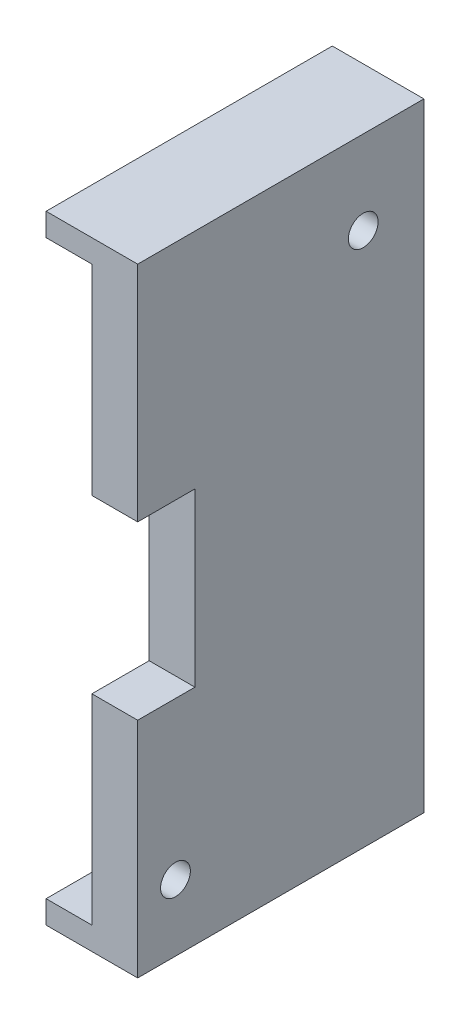
ISO-10303-21;
HEADER;
FILE_DESCRIPTION(('STEP AP214'),'2;1');
FILE_NAME('part.step','',(''),(''),'','','');
FILE_SCHEMA(('AUTOMOTIVE_DESIGN { 1 0 10303 214 1 1 1 1 }'));
ENDSEC;
DATA;
#1=APPLICATION_CONTEXT('core data for automotive mechanical design processes');
#2=APPLICATION_PROTOCOL_DEFINITION('international standard','automotive_design',2000,#1);
#3=PRODUCT_CONTEXT('',#1,'mechanical');
#4=PRODUCT('Part','Part','',(#3));
#5=PRODUCT_RELATED_PRODUCT_CATEGORY('part','',(#4));
#6=PRODUCT_DEFINITION_FORMATION('','',#4);
#7=PRODUCT_DEFINITION_CONTEXT('part definition',#1,'design');
#8=PRODUCT_DEFINITION('design','',#6,#7);
#9=PRODUCT_DEFINITION_SHAPE('','',#8);
#10=(LENGTH_UNIT() NAMED_UNIT(*) SI_UNIT(.MILLI.,.METRE.));
#11=(NAMED_UNIT(*) PLANE_ANGLE_UNIT() SI_UNIT($,.RADIAN.));
#12=(NAMED_UNIT(*) SI_UNIT($,.STERADIAN.) SOLID_ANGLE_UNIT());
#13=UNCERTAINTY_MEASURE_WITH_UNIT(LENGTH_MEASURE(1.E-05),#10,'distance_accuracy_value','');
#14=(GEOMETRIC_REPRESENTATION_CONTEXT(3) GLOBAL_UNCERTAINTY_ASSIGNED_CONTEXT((#13)) GLOBAL_UNIT_ASSIGNED_CONTEXT((#10,
#11,#12)) REPRESENTATION_CONTEXT('',''));
#15=CARTESIAN_POINT('',(0.,0.,0.));
#16=DIRECTION('',(0.,0.,1.));
#17=DIRECTION('',(1.,0.,0.));
#18=AXIS2_PLACEMENT_3D('',#15,#16,#17);
#19=CARTESIAN_POINT('',(90.,24.,-100.));
#20=DIRECTION('',(0.,0.,1.));
#21=DIRECTION('',(1.,0.,0.));
#22=AXIS2_PLACEMENT_3D('',#19,#20,#21);
#23=PLANE('',#22);
#24=DIRECTION('',(0.,-1.,0.));
#25=VECTOR('',#24,1.);
#26=CARTESIAN_POINT('',(94.,22.,-100.));
#27=LINE('',#26,#25);
#28=CARTESIAN_POINT('',(94.,22.,-100.));
#29=VERTEX_POINT('',#28);
#30=CARTESIAN_POINT('',(94.,4.5,-100.));
#31=VERTEX_POINT('',#30);
#32=EDGE_CURVE('E177',#29,#31,#27,.T.);
#33=ORIENTED_EDGE('',*,*,#32,.T.);
#34=DIRECTION('',(-1.,0.,0.));
#35=VECTOR('',#34,1.);
#36=CARTESIAN_POINT('',(98.,4.5,-100.));
#37=LINE('',#36,#35);
#38=CARTESIAN_POINT('',(98.,4.5,-100.));
#39=VERTEX_POINT('',#38);
#40=EDGE_CURVE('E151',#39,#31,#37,.T.);
#41=ORIENTED_EDGE('',*,*,#40,.F.);
#42=DIRECTION('',(0.,-1.,0.));
#43=VECTOR('',#42,1.);
#44=CARTESIAN_POINT('',(98.,24.,-100.));
#45=LINE('',#44,#43);
#46=CARTESIAN_POINT('',(98.,24.,-100.));
#47=VERTEX_POINT('',#46);
#48=EDGE_CURVE('E157',#47,#39,#45,.T.);
#49=ORIENTED_EDGE('',*,*,#48,.F.);
#50=DIRECTION('',(1.,0.,0.));
#51=VECTOR('',#50,1.);
#52=CARTESIAN_POINT('',(90.,24.,-100.));
#53=LINE('',#52,#51);
#54=CARTESIAN_POINT('',(90.,24.,-100.));
#55=VERTEX_POINT('',#54);
#56=EDGE_CURVE('E232',#55,#47,#53,.T.);
#57=ORIENTED_EDGE('',*,*,#56,.F.);
#58=DIRECTION('',(0.,-1.,0.));
#59=VECTOR('',#58,1.);
#60=CARTESIAN_POINT('',(90.,24.,-100.));
#61=LINE('',#60,#59);
#62=CARTESIAN_POINT('',(90.,22.,-100.));
#63=VERTEX_POINT('',#62);
#64=EDGE_CURVE('E221',#55,#63,#61,.T.);
#65=ORIENTED_EDGE('',*,*,#64,.T.);
#66=DIRECTION('',(-1.,0.,0.));
#67=VECTOR('',#66,1.);
#68=CARTESIAN_POINT('',(94.,22.,-100.));
#69=LINE('',#68,#67);
#70=EDGE_CURVE('E199',#29,#63,#69,.T.);
#71=ORIENTED_EDGE('',*,*,#70,.F.);
#72=EDGE_LOOP('',(#33,#41,#49,#57,#65,#71));
#73=FACE_BOUND('',#72,.T.);
#74=ADVANCED_FACE('F43',(#73),#23,.T.);
#75=CARTESIAN_POINT('',(98.,-10.5,-100.));
#76=VERTEX_POINT('',#75);
#77=CARTESIAN_POINT('',(98.,-30.,-100.));
#78=VERTEX_POINT('',#77);
#79=EDGE_CURVE('E205',#76,#78,#45,.T.);
#80=ORIENTED_EDGE('',*,*,#79,.F.);
#81=DIRECTION('',(-1.,0.,0.));
#82=VECTOR('',#81,1.);
#83=CARTESIAN_POINT('',(98.,-10.5,-100.));
#84=LINE('',#83,#82);
#85=CARTESIAN_POINT('',(94.,-10.5,-100.));
#86=VERTEX_POINT('',#85);
#87=EDGE_CURVE('E167',#76,#86,#84,.T.);
#88=ORIENTED_EDGE('',*,*,#87,.T.);
#89=CARTESIAN_POINT('',(94.,-28.,-100.));
#90=VERTEX_POINT('',#89);
#91=EDGE_CURVE('E176',#86,#90,#27,.T.);
#92=ORIENTED_EDGE('',*,*,#91,.T.);
#93=DIRECTION('',(-1.,0.,0.));
#94=VECTOR('',#93,1.);
#95=CARTESIAN_POINT('',(94.,-28.,-100.));
#96=LINE('',#95,#94);
#97=CARTESIAN_POINT('',(90.,-28.,-100.));
#98=VERTEX_POINT('',#97);
#99=EDGE_CURVE('E195',#90,#98,#96,.T.);
#100=ORIENTED_EDGE('',*,*,#99,.T.);
#101=CARTESIAN_POINT('',(90.,-30.,-100.));
#102=VERTEX_POINT('',#101);
#103=EDGE_CURVE('E220',#98,#102,#61,.T.);
#104=ORIENTED_EDGE('',*,*,#103,.T.);
#105=DIRECTION('',(1.,0.,0.));
#106=VECTOR('',#105,1.);
#107=CARTESIAN_POINT('',(90.,-30.,-100.));
#108=LINE('',#107,#106);
#109=EDGE_CURVE('E240',#102,#78,#108,.T.);
#110=ORIENTED_EDGE('',*,*,#109,.T.);
#111=EDGE_LOOP('',(#80,#88,#92,#100,#104,#110));
#112=FACE_BOUND('',#111,.T.);
#113=ADVANCED_FACE('F282',(#112),#23,.T.);
#114=CARTESIAN_POINT('',(98.,0.,0.));
#115=DIRECTION('',(1.,0.,0.));
#116=DIRECTION('',(0.,0.,-1.));
#117=AXIS2_PLACEMENT_3D('',#114,#115,#116);
#118=PLANE('',#117);
#119=CARTESIAN_POINT('',(98.,16.7,-119.7));
#120=DIRECTION('',(1.,0.,0.));
#121=DIRECTION('',(0.,0.,-1.));
#122=AXIS2_PLACEMENT_3D('',#119,#120,#121);
#123=CIRCLE('',#122,1.29999999999999);
#124=CARTESIAN_POINT('',(98.,16.7,-121.));
#125=VERTEX_POINT('',#124);
#126=EDGE_CURVE('E263',#125,#125,#123,.T.);
#127=ORIENTED_EDGE('',*,*,#126,.F.);
#128=EDGE_LOOP('',(#127));
#129=FACE_BOUND('',#128,.T.);
#130=CARTESIAN_POINT('',(98.,-24.2,-103.3));
#131=DIRECTION('',(1.,0.,0.));
#132=DIRECTION('',(0.,0.,-1.));
#133=AXIS2_PLACEMENT_3D('',#130,#131,#132);
#134=CIRCLE('',#133,1.29999999999999);
#135=CARTESIAN_POINT('',(98.,-24.2,-104.6));
#136=VERTEX_POINT('',#135);
#137=EDGE_CURVE('E270',#136,#136,#134,.T.);
#138=ORIENTED_EDGE('',*,*,#137,.F.);
#139=EDGE_LOOP('',(#138));
#140=FACE_BOUND('',#139,.T.);
#141=ORIENTED_EDGE('',*,*,#48,.T.);
#142=DIRECTION('',(0.,0.,1.));
#143=VECTOR('',#142,1.);
#144=CARTESIAN_POINT('',(98.,4.5,-105.));
#145=LINE('',#144,#143);
#146=CARTESIAN_POINT('',(98.,4.5,-105.));
#147=VERTEX_POINT('',#146);
#148=EDGE_CURVE('E143',#147,#39,#145,.T.);
#149=ORIENTED_EDGE('',*,*,#148,.F.);
#150=DIRECTION('',(0.,1.,0.));
#151=VECTOR('',#150,1.);
#152=CARTESIAN_POINT('',(98.,4.5,-105.));
#153=LINE('',#152,#151);
#154=CARTESIAN_POINT('',(98.,-10.5,-105.));
#155=VERTEX_POINT('',#154);
#156=EDGE_CURVE('E134',#155,#147,#153,.T.);
#157=ORIENTED_EDGE('',*,*,#156,.F.);
#158=DIRECTION('',(0.,0.,-1.));
#159=VECTOR('',#158,1.);
#160=CARTESIAN_POINT('',(98.,-10.5,-105.));
#161=LINE('',#160,#159);
#162=EDGE_CURVE('E159',#76,#155,#161,.T.);
#163=ORIENTED_EDGE('',*,*,#162,.F.);
#164=ORIENTED_EDGE('',*,*,#79,.T.);
#165=DIRECTION('',(0.,0.,1.));
#166=VECTOR('',#165,1.);
#167=CARTESIAN_POINT('',(98.,-30.,-125.));
#168=LINE('',#167,#166);
#169=CARTESIAN_POINT('',(98.,-30.,-125.));
#170=VERTEX_POINT('',#169);
#171=EDGE_CURVE('E208',#170,#78,#168,.T.);
#172=ORIENTED_EDGE('',*,*,#171,.F.);
#173=DIRECTION('',(0.,-1.,0.));
#174=VECTOR('',#173,1.);
#175=CARTESIAN_POINT('',(98.,24.,-125.));
#176=LINE('',#175,#174);
#177=CARTESIAN_POINT('',(98.,24.,-125.));
#178=VERTEX_POINT('',#177);
#179=EDGE_CURVE('E212',#178,#170,#176,.T.);
#180=ORIENTED_EDGE('',*,*,#179,.F.);
#181=DIRECTION('',(0.,0.,1.));
#182=VECTOR('',#181,1.);
#183=CARTESIAN_POINT('',(98.,24.,-125.));
#184=LINE('',#183,#182);
#185=EDGE_CURVE('E202',#178,#47,#184,.T.);
#186=ORIENTED_EDGE('',*,*,#185,.T.);
#187=EDGE_LOOP('',(#141,#149,#157,#163,#164,#172,#180,#186));
#188=FACE_BOUND('',#187,.T.);
#189=ADVANCED_FACE('F154',(#129,#140,#188),#118,.T.);
#190=CARTESIAN_POINT('',(94.,0.,0.));
#191=DIRECTION('',(1.,0.,0.));
#192=DIRECTION('',(0.,0.,-1.));
#193=AXIS2_PLACEMENT_3D('',#190,#191,#192);
#194=PLANE('',#193);
#195=CARTESIAN_POINT('',(94.,16.7,-119.7));
#196=DIRECTION('',(1.,0.,0.));
#197=DIRECTION('',(0.,0.,-1.));
#198=AXIS2_PLACEMENT_3D('',#195,#196,#197);
#199=CIRCLE('',#198,1.29999999999999);
#200=CARTESIAN_POINT('',(94.,16.7,-121.));
#201=VERTEX_POINT('',#200);
#202=EDGE_CURVE('E47',#201,#201,#199,.F.);
#203=ORIENTED_EDGE('',*,*,#202,.F.);
#204=EDGE_LOOP('',(#203));
#205=FACE_BOUND('',#204,.T.);
#206=CARTESIAN_POINT('',(94.,-24.2,-103.3));
#207=DIRECTION('',(1.,0.,0.));
#208=DIRECTION('',(0.,0.,-1.));
#209=AXIS2_PLACEMENT_3D('',#206,#207,#208);
#210=CIRCLE('',#209,1.29999999999999);
#211=CARTESIAN_POINT('',(94.,-24.2,-104.6));
#212=VERTEX_POINT('',#211);
#213=EDGE_CURVE('E260',#212,#212,#210,.F.);
#214=ORIENTED_EDGE('',*,*,#213,.F.);
#215=EDGE_LOOP('',(#214));
#216=FACE_BOUND('',#215,.T.);
#217=DIRECTION('',(0.,0.,-1.));
#218=VECTOR('',#217,1.);
#219=CARTESIAN_POINT('',(94.,4.50000000000001,0.));
#220=LINE('',#219,#218);
#221=CARTESIAN_POINT('',(94.,4.5,-105.));
#222=VERTEX_POINT('',#221);
#223=EDGE_CURVE('E11',#31,#222,#220,.T.);
#224=ORIENTED_EDGE('',*,*,#223,.F.);
#225=ORIENTED_EDGE('',*,*,#32,.F.);
#226=DIRECTION('',(0.,0.,1.));
#227=VECTOR('',#226,1.);
#228=CARTESIAN_POINT('',(94.,22.,-122.));
#229=LINE('',#228,#227);
#230=CARTESIAN_POINT('',(94.,22.,-122.));
#231=VERTEX_POINT('',#230);
#232=EDGE_CURVE('E150',#231,#29,#229,.T.);
#233=ORIENTED_EDGE('',*,*,#232,.F.);
#234=DIRECTION('',(0.,-1.,0.));
#235=VECTOR('',#234,1.);
#236=CARTESIAN_POINT('',(94.,22.,-122.));
#237=LINE('',#236,#235);
#238=CARTESIAN_POINT('',(94.,-28.,-122.));
#239=VERTEX_POINT('',#238);
#240=EDGE_CURVE('E185',#231,#239,#237,.T.);
#241=ORIENTED_EDGE('',*,*,#240,.T.);
#242=DIRECTION('',(0.,0.,1.));
#243=VECTOR('',#242,1.);
#244=CARTESIAN_POINT('',(94.,-28.,-122.));
#245=LINE('',#244,#243);
#246=EDGE_CURVE('E181',#239,#90,#245,.T.);
#247=ORIENTED_EDGE('',*,*,#246,.T.);
#248=ORIENTED_EDGE('',*,*,#91,.F.);
#249=DIRECTION('',(0.,0.,1.));
#250=VECTOR('',#249,1.);
#251=CARTESIAN_POINT('',(94.,-10.5,0.));
#252=LINE('',#251,#250);
#253=CARTESIAN_POINT('',(94.,-10.5,-105.));
#254=VERTEX_POINT('',#253);
#255=EDGE_CURVE('E256',#254,#86,#252,.T.);
#256=ORIENTED_EDGE('',*,*,#255,.F.);
#257=DIRECTION('',(0.,-1.,0.));
#258=VECTOR('',#257,1.);
#259=CARTESIAN_POINT('',(94.,0.,-105.));
#260=LINE('',#259,#258);
#261=EDGE_CURVE('E53',#222,#254,#260,.T.);
#262=ORIENTED_EDGE('',*,*,#261,.F.);
#263=EDGE_LOOP('',(#224,#225,#233,#241,#247,#248,#256,#262));
#264=FACE_BOUND('',#263,.T.);
#265=ADVANCED_FACE('F281',(#205,#216,#264),#194,.F.);
#266=CARTESIAN_POINT('',(90.,0.,0.));
#267=DIRECTION('',(1.,0.,0.));
#268=DIRECTION('',(0.,0.,-1.));
#269=AXIS2_PLACEMENT_3D('',#266,#267,#268);
#270=PLANE('',#269);
#271=DIRECTION('',(0.,0.,-1.));
#272=VECTOR('',#271,1.);
#273=CARTESIAN_POINT('',(90.,22.,0.));
#274=LINE('',#273,#272);
#275=CARTESIAN_POINT('',(90.,22.,-122.));
#276=VERTEX_POINT('',#275);
#277=EDGE_CURVE('E253',#63,#276,#274,.T.);
#278=ORIENTED_EDGE('',*,*,#277,.F.);
#279=ORIENTED_EDGE('',*,*,#64,.F.);
#280=DIRECTION('',(0.,0.,1.));
#281=VECTOR('',#280,1.);
#282=CARTESIAN_POINT('',(90.,24.,-125.));
#283=LINE('',#282,#281);
#284=CARTESIAN_POINT('',(90.,24.,-125.));
#285=VERTEX_POINT('',#284);
#286=EDGE_CURVE('E216',#285,#55,#283,.T.);
#287=ORIENTED_EDGE('',*,*,#286,.F.);
#288=DIRECTION('',(0.,-1.,0.));
#289=VECTOR('',#288,1.);
#290=CARTESIAN_POINT('',(90.,24.,-125.));
#291=LINE('',#290,#289);
#292=CARTESIAN_POINT('',(90.,-30.,-125.));
#293=VERTEX_POINT('',#292);
#294=EDGE_CURVE('E229',#285,#293,#291,.T.);
#295=ORIENTED_EDGE('',*,*,#294,.T.);
#296=DIRECTION('',(0.,0.,1.));
#297=VECTOR('',#296,1.);
#298=CARTESIAN_POINT('',(90.,-30.,-125.));
#299=LINE('',#298,#297);
#300=EDGE_CURVE('E225',#293,#102,#299,.T.);
#301=ORIENTED_EDGE('',*,*,#300,.T.);
#302=ORIENTED_EDGE('',*,*,#103,.F.);
#303=DIRECTION('',(0.,0.,-1.));
#304=VECTOR('',#303,1.);
#305=CARTESIAN_POINT('',(90.,-28.,0.));
#306=LINE('',#305,#304);
#307=CARTESIAN_POINT('',(90.,-28.,-122.));
#308=VERTEX_POINT('',#307);
#309=EDGE_CURVE('E249',#98,#308,#306,.T.);
#310=ORIENTED_EDGE('',*,*,#309,.T.);
#311=DIRECTION('',(0.,1.,0.));
#312=VECTOR('',#311,1.);
#313=CARTESIAN_POINT('',(90.,0.,-122.));
#314=LINE('',#313,#312);
#315=EDGE_CURVE('E236',#308,#276,#314,.T.);
#316=ORIENTED_EDGE('',*,*,#315,.T.);
#317=EDGE_LOOP('',(#278,#279,#287,#295,#301,#302,#310,#316));
#318=FACE_BOUND('',#317,.T.);
#319=ADVANCED_FACE('F289',(#318),#270,.F.);
#320=CARTESIAN_POINT('',(90.,24.,-125.));
#321=DIRECTION('',(0.,1.,0.));
#322=DIRECTION('',(0.,0.,1.));
#323=AXIS2_PLACEMENT_3D('',#320,#321,#322);
#324=PLANE('',#323);
#325=ORIENTED_EDGE('',*,*,#56,.T.);
#326=ORIENTED_EDGE('',*,*,#185,.F.);
#327=DIRECTION('',(1.,0.,0.));
#328=VECTOR('',#327,1.);
#329=CARTESIAN_POINT('',(90.,24.,-125.));
#330=LINE('',#329,#328);
#331=EDGE_CURVE('E233',#285,#178,#330,.T.);
#332=ORIENTED_EDGE('',*,*,#331,.F.);
#333=ORIENTED_EDGE('',*,*,#286,.T.);
#334=EDGE_LOOP('',(#325,#326,#332,#333));
#335=FACE_BOUND('',#334,.T.);
#336=ADVANCED_FACE('F45',(#335),#324,.T.);
#337=CARTESIAN_POINT('',(90.,24.,-125.));
#338=DIRECTION('',(0.,0.,1.));
#339=DIRECTION('',(1.,0.,0.));
#340=AXIS2_PLACEMENT_3D('',#337,#338,#339);
#341=PLANE('',#340);
#342=ORIENTED_EDGE('',*,*,#331,.T.);
#343=ORIENTED_EDGE('',*,*,#179,.T.);
#344=DIRECTION('',(1.,0.,0.));
#345=VECTOR('',#344,1.);
#346=CARTESIAN_POINT('',(90.,-30.,-125.));
#347=LINE('',#346,#345);
#348=EDGE_CURVE('E237',#293,#170,#347,.T.);
#349=ORIENTED_EDGE('',*,*,#348,.F.);
#350=ORIENTED_EDGE('',*,*,#294,.F.);
#351=EDGE_LOOP('',(#342,#343,#349,#350));
#352=FACE_BOUND('',#351,.T.);
#353=ADVANCED_FACE('F304',(#352),#341,.F.);
#354=CARTESIAN_POINT('',(90.,-30.,-125.));
#355=DIRECTION('',(0.,1.,0.));
#356=DIRECTION('',(0.,0.,1.));
#357=AXIS2_PLACEMENT_3D('',#354,#355,#356);
#358=PLANE('',#357);
#359=ORIENTED_EDGE('',*,*,#348,.T.);
#360=ORIENTED_EDGE('',*,*,#171,.T.);
#361=ORIENTED_EDGE('',*,*,#109,.F.);
#362=ORIENTED_EDGE('',*,*,#300,.F.);
#363=EDGE_LOOP('',(#359,#360,#361,#362));
#364=FACE_BOUND('',#363,.T.);
#365=ADVANCED_FACE('F300',(#364),#358,.F.);
#366=CARTESIAN_POINT('',(94.,22.,-122.));
#367=DIRECTION('',(0.,-1.,0.));
#368=DIRECTION('',(0.,0.,-1.));
#369=AXIS2_PLACEMENT_3D('',#366,#367,#368);
#370=PLANE('',#369);
#371=ORIENTED_EDGE('',*,*,#277,.T.);
#372=DIRECTION('',(-1.,0.,0.));
#373=VECTOR('',#372,1.);
#374=CARTESIAN_POINT('',(94.,22.,-122.));
#375=LINE('',#374,#373);
#376=EDGE_CURVE('E69',#231,#276,#375,.T.);
#377=ORIENTED_EDGE('',*,*,#376,.F.);
#378=ORIENTED_EDGE('',*,*,#232,.T.);
#379=ORIENTED_EDGE('',*,*,#70,.T.);
#380=EDGE_LOOP('',(#371,#377,#378,#379));
#381=FACE_BOUND('',#380,.T.);
#382=ADVANCED_FACE('F303',(#381),#370,.T.);
#383=CARTESIAN_POINT('',(94.,-28.,-122.));
#384=DIRECTION('',(0.,-1.,0.));
#385=DIRECTION('',(0.,0.,-1.));
#386=AXIS2_PLACEMENT_3D('',#383,#384,#385);
#387=PLANE('',#386);
#388=ORIENTED_EDGE('',*,*,#99,.F.);
#389=ORIENTED_EDGE('',*,*,#246,.F.);
#390=DIRECTION('',(-1.,0.,0.));
#391=VECTOR('',#390,1.);
#392=CARTESIAN_POINT('',(94.,-28.,-122.));
#393=LINE('',#392,#391);
#394=EDGE_CURVE('E191',#239,#308,#393,.T.);
#395=ORIENTED_EDGE('',*,*,#394,.T.);
#396=ORIENTED_EDGE('',*,*,#309,.F.);
#397=EDGE_LOOP('',(#388,#389,#395,#396));
#398=FACE_BOUND('',#397,.T.);
#399=ADVANCED_FACE('F337',(#398),#387,.F.);
#400=CARTESIAN_POINT('',(94.,22.,-122.));
#401=DIRECTION('',(0.,0.,-1.));
#402=DIRECTION('',(0.,1.,0.));
#403=AXIS2_PLACEMENT_3D('',#400,#401,#402);
#404=PLANE('',#403);
#405=ORIENTED_EDGE('',*,*,#394,.F.);
#406=ORIENTED_EDGE('',*,*,#240,.F.);
#407=ORIENTED_EDGE('',*,*,#376,.T.);
#408=ORIENTED_EDGE('',*,*,#315,.F.);
#409=EDGE_LOOP('',(#405,#406,#407,#408));
#410=FACE_BOUND('',#409,.T.);
#411=ADVANCED_FACE('F339',(#410),#404,.F.);
#412=CARTESIAN_POINT('',(98.,4.5,-105.));
#413=DIRECTION('',(0.,0.,1.));
#414=DIRECTION('',(1.,0.,0.));
#415=AXIS2_PLACEMENT_3D('',#412,#413,#414);
#416=PLANE('',#415);
#417=ORIENTED_EDGE('',*,*,#261,.T.);
#418=DIRECTION('',(-1.,0.,0.));
#419=VECTOR('',#418,1.);
#420=CARTESIAN_POINT('',(98.,-10.5,-105.));
#421=LINE('',#420,#419);
#422=EDGE_CURVE('E61',#155,#254,#421,.T.);
#423=ORIENTED_EDGE('',*,*,#422,.F.);
#424=ORIENTED_EDGE('',*,*,#156,.T.);
#425=DIRECTION('',(-1.,0.,0.));
#426=VECTOR('',#425,1.);
#427=CARTESIAN_POINT('',(98.,4.5,-105.));
#428=LINE('',#427,#426);
#429=EDGE_CURVE('E137',#147,#222,#428,.T.);
#430=ORIENTED_EDGE('',*,*,#429,.T.);
#431=EDGE_LOOP('',(#417,#423,#424,#430));
#432=FACE_BOUND('',#431,.T.);
#433=ADVANCED_FACE('F136',(#432),#416,.T.);
#434=CARTESIAN_POINT('',(98.,4.5,-105.));
#435=DIRECTION('',(0.,-1.,0.));
#436=DIRECTION('',(0.,0.,-1.));
#437=AXIS2_PLACEMENT_3D('',#434,#435,#436);
#438=PLANE('',#437);
#439=ORIENTED_EDGE('',*,*,#223,.T.);
#440=ORIENTED_EDGE('',*,*,#429,.F.);
#441=ORIENTED_EDGE('',*,*,#148,.T.);
#442=ORIENTED_EDGE('',*,*,#40,.T.);
#443=EDGE_LOOP('',(#439,#440,#441,#442));
#444=FACE_BOUND('',#443,.T.);
#445=ADVANCED_FACE('F146',(#444),#438,.T.);
#446=CARTESIAN_POINT('',(98.,-10.5,-105.));
#447=DIRECTION('',(0.,1.,0.));
#448=DIRECTION('',(0.,0.,1.));
#449=AXIS2_PLACEMENT_3D('',#446,#447,#448);
#450=PLANE('',#449);
#451=ORIENTED_EDGE('',*,*,#255,.T.);
#452=ORIENTED_EDGE('',*,*,#87,.F.);
#453=ORIENTED_EDGE('',*,*,#162,.T.);
#454=ORIENTED_EDGE('',*,*,#422,.T.);
#455=EDGE_LOOP('',(#451,#452,#453,#454));
#456=FACE_BOUND('',#455,.T.);
#457=ADVANCED_FACE('F388',(#456),#450,.T.);
#458=CARTESIAN_POINT('',(90.,-24.2,-103.3));
#459=DIRECTION('',(-1.,0.,0.));
#460=DIRECTION('',(0.,0.,1.));
#461=AXIS2_PLACEMENT_3D('',#458,#459,#460);
#462=CYLINDRICAL_SURFACE('',#461,1.29999999999999);
#463=ORIENTED_EDGE('',*,*,#137,.T.);
#464=EDGE_LOOP('',(#463));
#465=FACE_BOUND('',#464,.T.);
#466=ORIENTED_EDGE('',*,*,#213,.T.);
#467=EDGE_LOOP('',(#466));
#468=FACE_BOUND('',#467,.T.);
#469=ADVANCED_FACE('F278',(#465,#468),#462,.F.);
#470=CARTESIAN_POINT('',(90.,16.7,-119.7));
#471=DIRECTION('',(-1.,0.,0.));
#472=DIRECTION('',(0.,0.,1.));
#473=AXIS2_PLACEMENT_3D('',#470,#471,#472);
#474=CYLINDRICAL_SURFACE('',#473,1.29999999999999);
#475=ORIENTED_EDGE('',*,*,#126,.T.);
#476=EDGE_LOOP('',(#475));
#477=FACE_BOUND('',#476,.T.);
#478=ORIENTED_EDGE('',*,*,#202,.T.);
#479=EDGE_LOOP('',(#478));
#480=FACE_BOUND('',#479,.T.);
#481=ADVANCED_FACE('F413',(#477,#480),#474,.F.);
#482=CLOSED_SHELL('',(#74,#113,#189,#265,#319,#336,#353,#365,#382,#399,#411,#433,#445,#457,#469,#481));
#483=MANIFOLD_SOLID_BREP('B2',#482);
#484=ADVANCED_BREP_SHAPE_REPRESENTATION('',(#18,#483),#14);
#485=SHAPE_DEFINITION_REPRESENTATION(#9,#484);
ENDSEC;
END-ISO-10303-21;
